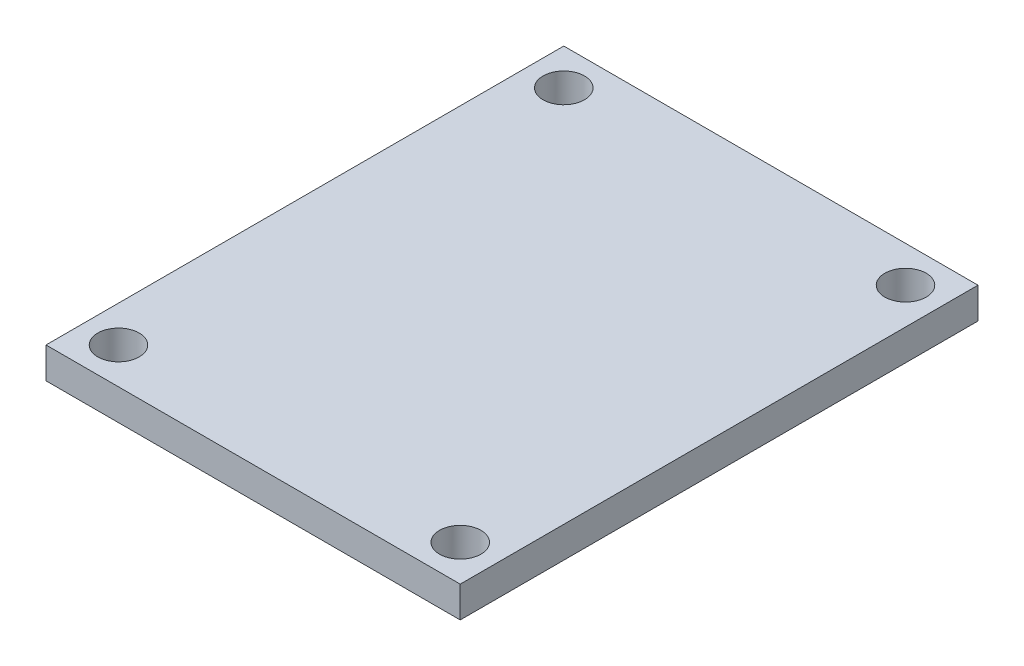
ISO-10303-21;
HEADER;
FILE_DESCRIPTION(('STEP AP214'),'2;1');
FILE_NAME('part.step','',(''),(''),'','','');
FILE_SCHEMA(('AUTOMOTIVE_DESIGN { 1 0 10303 214 1 1 1 1 }'));
ENDSEC;
DATA;
#1=APPLICATION_CONTEXT('core data for automotive mechanical design processes');
#2=APPLICATION_PROTOCOL_DEFINITION('international standard','automotive_design',2000,#1);
#3=PRODUCT_CONTEXT('',#1,'mechanical');
#4=PRODUCT('Part','Part','',(#3));
#5=PRODUCT_RELATED_PRODUCT_CATEGORY('part','',(#4));
#6=PRODUCT_DEFINITION_FORMATION('','',#4);
#7=PRODUCT_DEFINITION_CONTEXT('part definition',#1,'design');
#8=PRODUCT_DEFINITION('design','',#6,#7);
#9=PRODUCT_DEFINITION_SHAPE('','',#8);
#10=(LENGTH_UNIT() NAMED_UNIT(*) SI_UNIT(.MILLI.,.METRE.));
#11=(NAMED_UNIT(*) PLANE_ANGLE_UNIT() SI_UNIT($,.RADIAN.));
#12=(NAMED_UNIT(*) SI_UNIT($,.STERADIAN.) SOLID_ANGLE_UNIT());
#13=UNCERTAINTY_MEASURE_WITH_UNIT(LENGTH_MEASURE(1.E-05),#10,'distance_accuracy_value','');
#14=(GEOMETRIC_REPRESENTATION_CONTEXT(3) GLOBAL_UNCERTAINTY_ASSIGNED_CONTEXT((#13)) GLOBAL_UNIT_ASSIGNED_CONTEXT((#10,
#11,#12)) REPRESENTATION_CONTEXT('',''));
#15=CARTESIAN_POINT('',(0.,0.,0.));
#16=DIRECTION('',(0.,0.,1.));
#17=DIRECTION('',(1.,0.,0.));
#18=AXIS2_PLACEMENT_3D('',#15,#16,#17);
#19=CARTESIAN_POINT('',(254.,38.1,317.5));
#20=DIRECTION('',(-1.,0.,0.));
#21=DIRECTION('',(0.,0.,1.));
#22=AXIS2_PLACEMENT_3D('',#19,#20,#21);
#23=PLANE('',#22);
#24=DIRECTION('',(0.,0.,-1.));
#25=VECTOR('',#24,1.);
#26=CARTESIAN_POINT('',(254.,0.,317.5));
#27=LINE('',#26,#25);
#28=CARTESIAN_POINT('',(254.,0.,317.5));
#29=VERTEX_POINT('',#28);
#30=CARTESIAN_POINT('',(254.,0.,-317.5));
#31=VERTEX_POINT('',#30);
#32=EDGE_CURVE('E100',#29,#31,#27,.T.);
#33=ORIENTED_EDGE('',*,*,#32,.T.);
#34=DIRECTION('',(0.,-1.,0.));
#35=VECTOR('',#34,1.);
#36=CARTESIAN_POINT('',(254.,38.1,-317.5));
#37=LINE('',#36,#35);
#38=CARTESIAN_POINT('',(254.,38.1,-317.5));
#39=VERTEX_POINT('',#38);
#40=EDGE_CURVE('E11',#39,#31,#37,.T.);
#41=ORIENTED_EDGE('',*,*,#40,.F.);
#42=DIRECTION('',(0.,0.,-1.));
#43=VECTOR('',#42,1.);
#44=CARTESIAN_POINT('',(254.,38.1,317.5));
#45=LINE('',#44,#43);
#46=CARTESIAN_POINT('',(254.,38.1,317.5));
#47=VERTEX_POINT('',#46);
#48=EDGE_CURVE('E88',#47,#39,#45,.T.);
#49=ORIENTED_EDGE('',*,*,#48,.F.);
#50=DIRECTION('',(0.,-1.,0.));
#51=VECTOR('',#50,1.);
#52=CARTESIAN_POINT('',(254.,38.1,317.5));
#53=LINE('',#52,#51);
#54=EDGE_CURVE('E96',#47,#29,#53,.T.);
#55=ORIENTED_EDGE('',*,*,#54,.T.);
#56=EDGE_LOOP('',(#33,#41,#49,#55));
#57=FACE_BOUND('',#56,.T.);
#58=ADVANCED_FACE('F37',(#57),#23,.F.);
#59=CARTESIAN_POINT('',(-254.,38.1,-317.5));
#60=DIRECTION('',(0.,0.,1.));
#61=DIRECTION('',(1.,0.,0.));
#62=AXIS2_PLACEMENT_3D('',#59,#60,#61);
#63=PLANE('',#62);
#64=DIRECTION('',(-1.,0.,0.));
#65=VECTOR('',#64,1.);
#66=CARTESIAN_POINT('',(-254.,0.,-317.5));
#67=LINE('',#66,#65);
#68=CARTESIAN_POINT('',(-254.,0.,-317.5));
#69=VERTEX_POINT('',#68);
#70=EDGE_CURVE('E92',#31,#69,#67,.T.);
#71=ORIENTED_EDGE('',*,*,#70,.T.);
#72=DIRECTION('',(0.,-1.,0.));
#73=VECTOR('',#72,1.);
#74=CARTESIAN_POINT('',(-254.,38.1,-317.5));
#75=LINE('',#74,#73);
#76=CARTESIAN_POINT('',(-254.,38.1,-317.5));
#77=VERTEX_POINT('',#76);
#78=EDGE_CURVE('E45',#77,#69,#75,.T.);
#79=ORIENTED_EDGE('',*,*,#78,.F.);
#80=DIRECTION('',(-1.,0.,0.));
#81=VECTOR('',#80,1.);
#82=CARTESIAN_POINT('',(-254.,38.1,-317.5));
#83=LINE('',#82,#81);
#84=EDGE_CURVE('E83',#39,#77,#83,.T.);
#85=ORIENTED_EDGE('',*,*,#84,.F.);
#86=ORIENTED_EDGE('',*,*,#40,.T.);
#87=EDGE_LOOP('',(#71,#79,#85,#86));
#88=FACE_BOUND('',#87,.T.);
#89=ADVANCED_FACE('F91',(#88),#63,.F.);
#90=CARTESIAN_POINT('',(-254.,38.1,317.5));
#91=DIRECTION('',(1.,0.,0.));
#92=DIRECTION('',(0.,0.,-1.));
#93=AXIS2_PLACEMENT_3D('',#90,#91,#92);
#94=PLANE('',#93);
#95=DIRECTION('',(0.,0.,1.));
#96=VECTOR('',#95,1.);
#97=CARTESIAN_POINT('',(-254.,0.,317.5));
#98=LINE('',#97,#96);
#99=CARTESIAN_POINT('',(-254.,0.,317.5));
#100=VERTEX_POINT('',#99);
#101=EDGE_CURVE('E70',#69,#100,#98,.T.);
#102=ORIENTED_EDGE('',*,*,#101,.T.);
#103=DIRECTION('',(0.,-1.,0.));
#104=VECTOR('',#103,1.);
#105=CARTESIAN_POINT('',(-254.,38.1,317.5));
#106=LINE('',#105,#104);
#107=CARTESIAN_POINT('',(-254.,38.1,317.5));
#108=VERTEX_POINT('',#107);
#109=EDGE_CURVE('E93',#108,#100,#106,.T.);
#110=ORIENTED_EDGE('',*,*,#109,.F.);
#111=DIRECTION('',(0.,0.,1.));
#112=VECTOR('',#111,1.);
#113=CARTESIAN_POINT('',(-254.,38.1,317.5));
#114=LINE('',#113,#112);
#115=EDGE_CURVE('E86',#77,#108,#114,.T.);
#116=ORIENTED_EDGE('',*,*,#115,.F.);
#117=ORIENTED_EDGE('',*,*,#78,.T.);
#118=EDGE_LOOP('',(#102,#110,#116,#117));
#119=FACE_BOUND('',#118,.T.);
#120=ADVANCED_FACE('F94',(#119),#94,.F.);
#121=CARTESIAN_POINT('',(-254.,38.1,317.5));
#122=DIRECTION('',(0.,0.,-1.));
#123=DIRECTION('',(-1.,0.,0.));
#124=AXIS2_PLACEMENT_3D('',#121,#122,#123);
#125=PLANE('',#124);
#126=DIRECTION('',(1.,0.,0.));
#127=VECTOR('',#126,1.);
#128=CARTESIAN_POINT('',(-254.,0.,317.5));
#129=LINE('',#128,#127);
#130=EDGE_CURVE('E76',#100,#29,#129,.T.);
#131=ORIENTED_EDGE('',*,*,#130,.T.);
#132=ORIENTED_EDGE('',*,*,#54,.F.);
#133=DIRECTION('',(1.,0.,0.));
#134=VECTOR('',#133,1.);
#135=CARTESIAN_POINT('',(-254.,38.1,317.5));
#136=LINE('',#135,#134);
#137=EDGE_CURVE('E53',#108,#47,#136,.T.);
#138=ORIENTED_EDGE('',*,*,#137,.F.);
#139=ORIENTED_EDGE('',*,*,#109,.T.);
#140=EDGE_LOOP('',(#131,#132,#138,#139));
#141=FACE_BOUND('',#140,.T.);
#142=ADVANCED_FACE('F108',(#141),#125,.F.);
#143=CARTESIAN_POINT('',(0.,38.1,0.));
#144=DIRECTION('',(0.,-1.,0.));
#145=DIRECTION('',(0.,0.,-1.));
#146=AXIS2_PLACEMENT_3D('',#143,#144,#145);
#147=PLANE('',#146);
#148=CARTESIAN_POINT('',(209.55,38.1,-273.05));
#149=DIRECTION('',(0.,1.,0.));
#150=DIRECTION('',(0.,0.,-1.));
#151=AXIS2_PLACEMENT_3D('',#148,#149,#150);
#152=CIRCLE('',#151,25.4);
#153=CARTESIAN_POINT('',(209.55,38.1,-298.45));
#154=VERTEX_POINT('',#153);
#155=EDGE_CURVE('E130',#154,#154,#152,.T.);
#156=ORIENTED_EDGE('',*,*,#155,.F.);
#157=EDGE_LOOP('',(#156));
#158=FACE_BOUND('',#157,.T.);
#159=CARTESIAN_POINT('',(209.55,38.1,273.05));
#160=DIRECTION('',(0.,1.,0.));
#161=DIRECTION('',(0.,0.,1.));
#162=AXIS2_PLACEMENT_3D('',#159,#160,#161);
#163=CIRCLE('',#162,25.4);
#164=CARTESIAN_POINT('',(209.55,38.1,298.45));
#165=VERTEX_POINT('',#164);
#166=EDGE_CURVE('E123',#165,#165,#163,.T.);
#167=ORIENTED_EDGE('',*,*,#166,.F.);
#168=EDGE_LOOP('',(#167));
#169=FACE_BOUND('',#168,.T.);
#170=CARTESIAN_POINT('',(-209.55,38.1,273.05));
#171=DIRECTION('',(0.,1.,0.));
#172=DIRECTION('',(0.,0.,-1.));
#173=AXIS2_PLACEMENT_3D('',#170,#171,#172);
#174=CIRCLE('',#173,25.4);
#175=CARTESIAN_POINT('',(-209.55,38.1,247.65));
#176=VERTEX_POINT('',#175);
#177=EDGE_CURVE('E124',#176,#176,#174,.T.);
#178=ORIENTED_EDGE('',*,*,#177,.F.);
#179=EDGE_LOOP('',(#178));
#180=FACE_BOUND('',#179,.T.);
#181=CARTESIAN_POINT('',(-209.55,38.1,-273.05));
#182=DIRECTION('',(0.,1.,0.));
#183=DIRECTION('',(0.,0.,1.));
#184=AXIS2_PLACEMENT_3D('',#181,#182,#183);
#185=CIRCLE('',#184,25.4);
#186=CARTESIAN_POINT('',(-209.55,38.1,-247.65));
#187=VERTEX_POINT('',#186);
#188=EDGE_CURVE('E116',#187,#187,#185,.T.);
#189=ORIENTED_EDGE('',*,*,#188,.F.);
#190=EDGE_LOOP('',(#189));
#191=FACE_BOUND('',#190,.T.);
#192=ORIENTED_EDGE('',*,*,#48,.T.);
#193=ORIENTED_EDGE('',*,*,#84,.T.);
#194=ORIENTED_EDGE('',*,*,#115,.T.);
#195=ORIENTED_EDGE('',*,*,#137,.T.);
#196=EDGE_LOOP('',(#192,#193,#194,#195));
#197=FACE_BOUND('',#196,.T.);
#198=ADVANCED_FACE('F84',(#158,#169,#180,#191,#197),#147,.F.);
#199=CARTESIAN_POINT('',(0.,0.,0.));
#200=DIRECTION('',(0.,-1.,0.));
#201=DIRECTION('',(0.,0.,-1.));
#202=AXIS2_PLACEMENT_3D('',#199,#200,#201);
#203=PLANE('',#202);
#204=CARTESIAN_POINT('',(209.55,0.,-273.05));
#205=DIRECTION('',(0.,-1.,0.));
#206=DIRECTION('',(0.,0.,-1.));
#207=AXIS2_PLACEMENT_3D('',#204,#205,#206);
#208=CIRCLE('',#207,25.4);
#209=CARTESIAN_POINT('',(209.55,0.,-298.45));
#210=VERTEX_POINT('',#209);
#211=EDGE_CURVE('E119',#210,#210,#208,.F.);
#212=ORIENTED_EDGE('',*,*,#211,.T.);
#213=EDGE_LOOP('',(#212));
#214=FACE_BOUND('',#213,.T.);
#215=CARTESIAN_POINT('',(209.55,0.,273.05));
#216=DIRECTION('',(0.,-1.,0.));
#217=DIRECTION('',(0.,0.,-1.));
#218=AXIS2_PLACEMENT_3D('',#215,#216,#217);
#219=CIRCLE('',#218,25.4);
#220=CARTESIAN_POINT('',(209.55,0.,247.65));
#221=VERTEX_POINT('',#220);
#222=EDGE_CURVE('E127',#221,#221,#219,.F.);
#223=ORIENTED_EDGE('',*,*,#222,.T.);
#224=EDGE_LOOP('',(#223));
#225=FACE_BOUND('',#224,.T.);
#226=CARTESIAN_POINT('',(-209.55,0.,273.05));
#227=DIRECTION('',(0.,-1.,0.));
#228=DIRECTION('',(0.,0.,-1.));
#229=AXIS2_PLACEMENT_3D('',#226,#227,#228);
#230=CIRCLE('',#229,25.4);
#231=CARTESIAN_POINT('',(-209.55,0.,247.65));
#232=VERTEX_POINT('',#231);
#233=EDGE_CURVE('E120',#232,#232,#230,.F.);
#234=ORIENTED_EDGE('',*,*,#233,.T.);
#235=EDGE_LOOP('',(#234));
#236=FACE_BOUND('',#235,.T.);
#237=CARTESIAN_POINT('',(-209.55,0.,-273.05));
#238=DIRECTION('',(0.,-1.,0.));
#239=DIRECTION('',(0.,0.,-1.));
#240=AXIS2_PLACEMENT_3D('',#237,#238,#239);
#241=CIRCLE('',#240,25.4);
#242=CARTESIAN_POINT('',(-209.55,0.,-298.45));
#243=VERTEX_POINT('',#242);
#244=EDGE_CURVE('E103',#243,#243,#241,.F.);
#245=ORIENTED_EDGE('',*,*,#244,.T.);
#246=EDGE_LOOP('',(#245));
#247=FACE_BOUND('',#246,.T.);
#248=ORIENTED_EDGE('',*,*,#32,.F.);
#249=ORIENTED_EDGE('',*,*,#130,.F.);
#250=ORIENTED_EDGE('',*,*,#101,.F.);
#251=ORIENTED_EDGE('',*,*,#70,.F.);
#252=EDGE_LOOP('',(#248,#249,#250,#251));
#253=FACE_BOUND('',#252,.T.);
#254=ADVANCED_FACE('F111',(#214,#225,#236,#247,#253),#203,.T.);
#255=CARTESIAN_POINT('',(-209.55,-71.8420489685533,-273.05));
#256=DIRECTION('',(0.,1.,0.));
#257=DIRECTION('',(0.,0.,1.));
#258=AXIS2_PLACEMENT_3D('',#255,#256,#257);
#259=CYLINDRICAL_SURFACE('',#258,25.4);
#260=ORIENTED_EDGE('',*,*,#188,.T.);
#261=EDGE_LOOP('',(#260));
#262=FACE_BOUND('',#261,.T.);
#263=ORIENTED_EDGE('',*,*,#244,.F.);
#264=EDGE_LOOP('',(#263));
#265=FACE_BOUND('',#264,.T.);
#266=ADVANCED_FACE('F150',(#262,#265),#259,.F.);
#267=CARTESIAN_POINT('',(-209.55,-71.8420489685533,273.05));
#268=DIRECTION('',(0.,1.,0.));
#269=DIRECTION('',(0.,0.,1.));
#270=AXIS2_PLACEMENT_3D('',#267,#268,#269);
#271=CYLINDRICAL_SURFACE('',#270,25.4);
#272=ORIENTED_EDGE('',*,*,#177,.T.);
#273=EDGE_LOOP('',(#272));
#274=FACE_BOUND('',#273,.T.);
#275=ORIENTED_EDGE('',*,*,#233,.F.);
#276=EDGE_LOOP('',(#275));
#277=FACE_BOUND('',#276,.T.);
#278=ADVANCED_FACE('F153',(#274,#277),#271,.F.);
#279=CARTESIAN_POINT('',(209.55,-71.8420489685533,273.05));
#280=DIRECTION('',(0.,1.,0.));
#281=DIRECTION('',(0.,0.,1.));
#282=AXIS2_PLACEMENT_3D('',#279,#280,#281);
#283=CYLINDRICAL_SURFACE('',#282,25.4);
#284=ORIENTED_EDGE('',*,*,#166,.T.);
#285=EDGE_LOOP('',(#284));
#286=FACE_BOUND('',#285,.T.);
#287=ORIENTED_EDGE('',*,*,#222,.F.);
#288=EDGE_LOOP('',(#287));
#289=FACE_BOUND('',#288,.T.);
#290=ADVANCED_FACE('F200',(#286,#289),#283,.F.);
#291=CARTESIAN_POINT('',(209.55,-71.8420489685533,-273.05));
#292=DIRECTION('',(0.,1.,0.));
#293=DIRECTION('',(0.,0.,1.));
#294=AXIS2_PLACEMENT_3D('',#291,#292,#293);
#295=CYLINDRICAL_SURFACE('',#294,25.4);
#296=ORIENTED_EDGE('',*,*,#155,.T.);
#297=EDGE_LOOP('',(#296));
#298=FACE_BOUND('',#297,.T.);
#299=ORIENTED_EDGE('',*,*,#211,.F.);
#300=EDGE_LOOP('',(#299));
#301=FACE_BOUND('',#300,.T.);
#302=ADVANCED_FACE('F138',(#298,#301),#295,.F.);
#303=CLOSED_SHELL('',(#58,#89,#120,#142,#198,#254,#266,#278,#290,#302));
#304=MANIFOLD_SOLID_BREP('B2',#303);
#305=ADVANCED_BREP_SHAPE_REPRESENTATION('',(#18,#304),#14);
#306=SHAPE_DEFINITION_REPRESENTATION(#9,#305);
ENDSEC;
END-ISO-10303-21;
